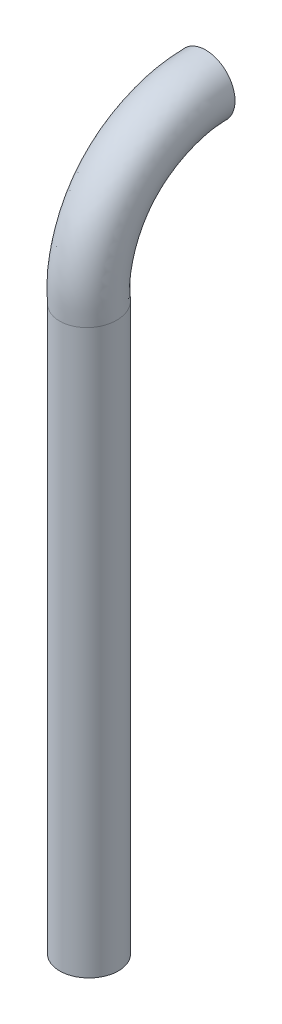
ISO-10303-21;
HEADER;
FILE_DESCRIPTION(('STEP AP214'),'2;1');
FILE_NAME('part.step','',(''),(''),'','','');
FILE_SCHEMA(('AUTOMOTIVE_DESIGN { 1 0 10303 214 1 1 1 1 }'));
ENDSEC;
DATA;
#1=APPLICATION_CONTEXT('core data for automotive mechanical design processes');
#2=APPLICATION_PROTOCOL_DEFINITION('international standard','automotive_design',2000,#1);
#3=PRODUCT_CONTEXT('',#1,'mechanical');
#4=PRODUCT('Part','Part','',(#3));
#5=PRODUCT_RELATED_PRODUCT_CATEGORY('part','',(#4));
#6=PRODUCT_DEFINITION_FORMATION('','',#4);
#7=PRODUCT_DEFINITION_CONTEXT('part definition',#1,'design');
#8=PRODUCT_DEFINITION('design','',#6,#7);
#9=PRODUCT_DEFINITION_SHAPE('','',#8);
#10=(LENGTH_UNIT() NAMED_UNIT(*) SI_UNIT(.MILLI.,.METRE.));
#11=(NAMED_UNIT(*) PLANE_ANGLE_UNIT() SI_UNIT($,.RADIAN.));
#12=(NAMED_UNIT(*) SI_UNIT($,.STERADIAN.) SOLID_ANGLE_UNIT());
#13=UNCERTAINTY_MEASURE_WITH_UNIT(LENGTH_MEASURE(1.E-05),#10,'distance_accuracy_value','');
#14=(GEOMETRIC_REPRESENTATION_CONTEXT(3) GLOBAL_UNCERTAINTY_ASSIGNED_CONTEXT((#13)) GLOBAL_UNIT_ASSIGNED_CONTEXT((#10,
#11,#12)) REPRESENTATION_CONTEXT('',''));
#15=CARTESIAN_POINT('',(0.,0.,0.));
#16=DIRECTION('',(0.,0.,1.));
#17=DIRECTION('',(1.,0.,0.));
#18=AXIS2_PLACEMENT_3D('',#15,#16,#17);
#19=CARTESIAN_POINT('',(0.500000000000001,12.,0.));
#20=CARTESIAN_POINT('',(0.500000000000001,11.9930657780444,0.116001043276116));
#21=CARTESIAN_POINT('',(0.500000000000001,11.9787542517183,0.355415356132909));
#22=CARTESIAN_POINT('',(0.500000000000001,11.8732889805314,0.710322294278507));
#23=CARTESIAN_POINT('',(0.500000000000001,11.7070321349135,1.05626849236097));
#24=CARTESIAN_POINT('',(0.500000000000001,11.4720913130819,1.37348710465269));
#25=CARTESIAN_POINT('',(0.500000000000001,11.1748759191565,1.63424427024337));
#26=CARTESIAN_POINT('',(0.500000000000001,10.8349846393884,1.82471981164898));
#27=CARTESIAN_POINT('',(0.500000000000001,10.4783081979391,1.94515211226652));
#28=CARTESIAN_POINT('',(0.500000000000001,10.1203360573505,2.00641317133854));
#29=CARTESIAN_POINT('',(0.500000000000001,9.88539442122458,1.99327449950961));
#30=CARTESIAN_POINT('',(0.500000000000001,9.77151871013415,1.98690621323232));
#31=CARTESIAN_POINT('',(0.500000000000001,13.,0.));
#32=CARTESIAN_POINT('',(0.500000000000001,12.9891316338656,0.180227196182847));
#33=CARTESIAN_POINT('',(0.500000000000001,12.9667004355208,0.55219773294359));
#34=CARTESIAN_POINT('',(0.500000000000001,12.8116512221261,1.06789627259224));
#35=CARTESIAN_POINT('',(0.500000000000001,12.5687138056712,1.57523482449269));
#36=CARTESIAN_POINT('',(0.500000000000001,12.2171018532432,2.05199658085992));
#37=CARTESIAN_POINT('',(0.500000000000001,11.7526071013549,2.4599571736331));
#38=CARTESIAN_POINT('',(0.500000000000001,11.2417162354822,2.74364311505457));
#39=CARTESIAN_POINT('',(0.500000000000001,10.7249424302498,2.92014520630552));
#40=CARTESIAN_POINT('',(0.500000000000001,10.1832293149059,3.00852030836141));
#41=CARTESIAN_POINT('',(0.500000000000001,9.86732765540138,2.99396240029424));
#42=CARTESIAN_POINT('',(0.500000000000001,9.71421079325677,2.98690621323232));
#43=CARTESIAN_POINT('',(-0.500000000000001,13.,0.));
#44=CARTESIAN_POINT('',(-0.500000000000001,12.9891316338656,0.180227196182847));
#45=CARTESIAN_POINT('',(-0.500000000000001,12.9667004355208,0.55219773294359));
#46=CARTESIAN_POINT('',(-0.500000000000001,12.8116512221261,1.06789627259224));
#47=CARTESIAN_POINT('',(-0.500000000000001,12.5687138056712,1.57523482449269));
#48=CARTESIAN_POINT('',(-0.500000000000001,12.2171018532432,2.05199658085992));
#49=CARTESIAN_POINT('',(-0.500000000000001,11.7526071013549,2.4599571736331));
#50=CARTESIAN_POINT('',(-0.500000000000001,11.2417162354822,2.74364311505457));
#51=CARTESIAN_POINT('',(-0.500000000000001,10.7249424302498,2.92014520630552));
#52=CARTESIAN_POINT('',(-0.500000000000001,10.1832293149059,3.00852030836141));
#53=CARTESIAN_POINT('',(-0.500000000000001,9.86732765540138,2.99396240029424));
#54=CARTESIAN_POINT('',(-0.500000000000001,9.71421079325677,2.98690621323232));
#55=CARTESIAN_POINT('',(-0.500000000000001,12.,0.));
#56=CARTESIAN_POINT('',(-0.500000000000001,11.9930657780444,0.116001043276116));
#57=CARTESIAN_POINT('',(-0.500000000000001,11.9787542517183,0.355415356132909));
#58=CARTESIAN_POINT('',(-0.500000000000001,11.8732889805314,0.710322294278507));
#59=CARTESIAN_POINT('',(-0.500000000000001,11.7070321349135,1.05626849236097));
#60=CARTESIAN_POINT('',(-0.500000000000001,11.4720913130819,1.37348710465269));
#61=CARTESIAN_POINT('',(-0.500000000000001,11.1748759191565,1.63424427024337));
#62=CARTESIAN_POINT('',(-0.500000000000001,10.8349846393884,1.82471981164898));
#63=CARTESIAN_POINT('',(-0.500000000000001,10.4783081979391,1.94515211226652));
#64=CARTESIAN_POINT('',(-0.500000000000001,10.1203360573505,2.00641317133854));
#65=CARTESIAN_POINT('',(-0.500000000000001,9.88539442122458,1.99327449950961));
#66=CARTESIAN_POINT('',(-0.500000000000001,9.77151871013415,1.98690621323232));
#67=CARTESIAN_POINT('',(-0.500000000000001,11.,0.));
#68=CARTESIAN_POINT('',(-0.500000000000001,10.9969999222232,0.051774890369384));
#69=CARTESIAN_POINT('',(-0.500000000000001,10.9908080679159,0.158632979322228));
#70=CARTESIAN_POINT('',(-0.500000000000001,10.9349267389366,0.352748315964771));
#71=CARTESIAN_POINT('',(-0.500000000000001,10.8453504641559,0.537302160229255));
#72=CARTESIAN_POINT('',(-0.500000000000001,10.7270807729206,0.694977628445463));
#73=CARTESIAN_POINT('',(-0.500000000000001,10.5971447369581,0.808531366853651));
#74=CARTESIAN_POINT('',(-0.500000000000001,10.4282530432947,0.905796508243399));
#75=CARTESIAN_POINT('',(-0.500000000000001,10.2316739656283,0.970159018227536));
#76=CARTESIAN_POINT('',(-0.500000000000001,10.0574427997951,1.00430603431567));
#77=CARTESIAN_POINT('',(-0.500000000000001,9.90346118704778,0.992586598724968));
#78=CARTESIAN_POINT('',(-0.500000000000001,9.82882662701154,0.986906213232319));
#79=CARTESIAN_POINT('',(0.500000000000001,11.,0.));
#80=CARTESIAN_POINT('',(0.500000000000001,10.9969999222232,0.051774890369384));
#81=CARTESIAN_POINT('',(0.500000000000001,10.9908080679159,0.158632979322228));
#82=CARTESIAN_POINT('',(0.500000000000001,10.9349267389366,0.352748315964771));
#83=CARTESIAN_POINT('',(0.500000000000001,10.8453504641559,0.537302160229255));
#84=CARTESIAN_POINT('',(0.500000000000001,10.7270807729206,0.694977628445463));
#85=CARTESIAN_POINT('',(0.500000000000001,10.5971447369581,0.808531366853651));
#86=CARTESIAN_POINT('',(0.500000000000001,10.4282530432947,0.905796508243399));
#87=CARTESIAN_POINT('',(0.500000000000001,10.2316739656283,0.970159018227536));
#88=CARTESIAN_POINT('',(0.500000000000001,10.0574427997951,1.00430603431567));
#89=CARTESIAN_POINT('',(0.500000000000001,9.90346118704778,0.992586598724968));
#90=CARTESIAN_POINT('',(0.500000000000001,9.82882662701154,0.986906213232319));
#91=CARTESIAN_POINT('',(0.500000000000001,12.,0.));
#92=CARTESIAN_POINT('',(0.500000000000001,11.9930657780444,0.116001043276116));
#93=CARTESIAN_POINT('',(0.500000000000001,11.9787542517183,0.355415356132909));
#94=CARTESIAN_POINT('',(0.500000000000001,11.8732889805314,0.710322294278507));
#95=CARTESIAN_POINT('',(0.500000000000001,11.7070321349135,1.05626849236097));
#96=CARTESIAN_POINT('',(0.500000000000001,11.4720913130819,1.37348710465269));
#97=CARTESIAN_POINT('',(0.500000000000001,11.1748759191565,1.63424427024337));
#98=CARTESIAN_POINT('',(0.500000000000001,10.8349846393884,1.82471981164898));
#99=CARTESIAN_POINT('',(0.500000000000001,10.4783081979391,1.94515211226652));
#100=CARTESIAN_POINT('',(0.500000000000001,10.1203360573505,2.00641317133854));
#101=CARTESIAN_POINT('',(0.500000000000001,9.88539442122458,1.99327449950961));
#102=CARTESIAN_POINT('',(0.500000000000001,9.77151871013415,1.98690621323232));
#103=(BOUNDED_SURFACE() B_SPLINE_SURFACE(3,3,((#19,#20,#21,#22,#23,#24,#25,#26,#27,#28,#29,#30),
(#31,#32,#33,#34,#35,#36,#37,#38,#39,#40,#41,#42),(#43,#44,#45,#46,#47,#48,#49,#50,#51,#52,#53,
#54),(#55,#56,#57,#58,#59,#60,#61,#62,#63,#64,#65,#66),(#67,#68,#69,#70,#71,#72,#73,#74,#75,#76,
#77,#78),(#79,#80,#81,#82,#83,#84,#85,#86,#87,#88,#89,#90),(#91,#92,#93,#94,#95,#96,#97,#98,#99,
#100,#101,#102)),.UNSPECIFIED.,.T.,.F.,.F.) B_SPLINE_SURFACE_WITH_KNOTS((4,3,4),(4,1,1,1,1,1,1,
1,1,4),(0.,0.5,1.),(0.,0.103484834511285,0.213582135521359,0.327929790440309,0.444900910622342,
0.563498430107345,0.678249695913363,0.790419034476106,0.898416551984604,1.),
.UNSPECIFIED.) GEOMETRIC_REPRESENTATION_ITEM() RATIONAL_B_SPLINE_SURFACE(((1.,1.,1.,1.,1.,1.,1.,
1.,1.,1.,1.,1.),(0.333333333333333,0.333333333333333,0.333333333333333,0.333333333333333,
0.333333333333333,0.333333333333334,0.333333333333333,0.333333333333333,0.333333333333333,
0.333333333333333,0.333333333333333,0.333333333333333),(0.333333333333333,0.333333333333333,
0.333333333333333,0.333333333333333,0.333333333333333,0.333333333333334,0.333333333333333,
0.333333333333333,0.333333333333333,0.333333333333333,0.333333333333333,0.333333333333333),(1.,
1.,1.,1.,1.,1.,1.,1.,1.,1.,1.,1.),(0.333333333333333,0.333333333333333,0.333333333333333,
0.333333333333333,0.333333333333333,0.333333333333334,0.333333333333333,0.333333333333333,
0.333333333333333,0.333333333333333,0.333333333333333,0.333333333333333),(0.333333333333333,
0.333333333333333,0.333333333333333,0.333333333333333,0.333333333333333,0.333333333333334,
0.333333333333333,0.333333333333333,0.333333333333333,0.333333333333333,0.333333333333333,
0.333333333333333),(1.,1.,1.,1.,1.,1.,1.,1.,1.,1.,1.,1.))) REPRESENTATION_ITEM('') SURFACE());
#104=CARTESIAN_POINT('',(0.,12.,0.));
#105=DIRECTION('',(0.,0.,1.));
#106=DIRECTION('',(1.,0.,0.));
#107=AXIS2_PLACEMENT_3D('',#104,#105,#106);
#108=CIRCLE('',#107,0.500000000000001);
#109=CARTESIAN_POINT('',(0.500000000000001,12.,0.));
#110=VERTEX_POINT('',#109);
#111=EDGE_CURVE('E11',#110,#110,#108,.T.);
#112=CARTESIAN_POINT('',(0.500000000000001,9.77151871013415,1.98690621323232));
#113=CARTESIAN_POINT('',(0.500000000000001,9.82882662701154,0.986906213232319));
#114=CARTESIAN_POINT('',(-0.500000000000001,9.82882662701154,0.986906213232319));
#115=CARTESIAN_POINT('',(-0.500000000000001,9.77151871013415,1.98690621323232));
#116=CARTESIAN_POINT('',(-0.500000000000001,9.71421079325677,2.98690621323232));
#117=CARTESIAN_POINT('',(0.500000000000001,9.71421079325677,2.98690621323232));
#118=CARTESIAN_POINT('',(0.500000000000001,9.77151871013415,1.98690621323232));
#119=(BOUNDED_CURVE() B_SPLINE_CURVE(3,(#112,#113,#114,#115,#116,#117,#118),.UNSPECIFIED.,.T.,
.F.) B_SPLINE_CURVE_WITH_KNOTS((4,3,4),(0.,0.5,1.),
.UNSPECIFIED.) CURVE() GEOMETRIC_REPRESENTATION_ITEM() RATIONAL_B_SPLINE_CURVE((1.,
0.333333333333333,0.333333333333333,1.,0.333333333333333,0.333333333333333,1.)) REPRESENTATION_ITEM(''));
#120=CARTESIAN_POINT('',(0.500000000000001,9.77151871013415,1.98690621323232));
#121=VERTEX_POINT('',#120);
#122=EDGE_CURVE('E50',#121,#121,#119,.T.);
#123=ORIENTED_EDGE('',*,*,#111,.T.);
#124=EDGE_LOOP('',(#123));
#125=FACE_BOUND('',#124,.T.);
#126=ORIENTED_EDGE('',*,*,#122,.T.);
#127=EDGE_LOOP('',(#126));
#128=FACE_BOUND('',#127,.T.);
#129=ADVANCED_FACE('F38',(#125,#128),#103,.T.);
#130=CARTESIAN_POINT('',(0.,12.,0.));
#131=DIRECTION('',(0.,0.,1.));
#132=DIRECTION('',(1.,0.,0.));
#133=AXIS2_PLACEMENT_3D('',#130,#131,#132);
#134=PLANE('',#133);
#135=ORIENTED_EDGE('',*,*,#111,.F.);
#136=EDGE_LOOP('',(#135));
#137=FACE_BOUND('',#136,.T.);
#138=ADVANCED_FACE('F71',(#137),#134,.F.);
#139=CARTESIAN_POINT('',(-0.500000000000001,0.157255388795142,1.98690621323232));
#140=DIRECTION('',(0.,-1.,0.));
#141=DIRECTION('',(0.,0.,-1.));
#142=AXIS2_PLACEMENT_3D('',#139,#140,#141);
#143=PLANE('',#142);
#144=CARTESIAN_POINT('',(0.,0.157255388795142,1.98690621323232));
#145=DIRECTION('',(0.,-1.,0.));
#146=DIRECTION('',(0.,0.,-1.));
#147=AXIS2_PLACEMENT_3D('',#144,#145,#146);
#148=CIRCLE('',#147,0.500000000000001);
#149=CARTESIAN_POINT('',(0.,0.157255388795142,1.48690621323232));
#150=VERTEX_POINT('',#149);
#151=EDGE_CURVE('E46',#150,#150,#148,.T.);
#152=ORIENTED_EDGE('',*,*,#151,.T.);
#153=EDGE_LOOP('',(#152));
#154=FACE_BOUND('',#153,.T.);
#155=ADVANCED_FACE('F66',(#154),#143,.T.);
#156=CARTESIAN_POINT('',(0.500000000000001,9.77151871013415,1.98690621323232));
#157=CARTESIAN_POINT('',(0.500000000000001,0.157255388795142,1.98690621323232));
#158=CARTESIAN_POINT('',(0.500000000000001,9.82882662701154,0.986906213232319));
#159=CARTESIAN_POINT('',(0.500000000000001,0.157255388795142,0.986906213232318));
#160=CARTESIAN_POINT('',(-0.500000000000001,9.82882662701154,0.986906213232319));
#161=CARTESIAN_POINT('',(-0.500000000000001,0.157255388795142,0.986906213232318));
#162=CARTESIAN_POINT('',(-0.500000000000001,9.77151871013415,1.98690621323232));
#163=CARTESIAN_POINT('',(-0.500000000000001,0.157255388795142,1.98690621323232));
#164=CARTESIAN_POINT('',(-0.500000000000001,9.71421079325677,2.98690621323232));
#165=CARTESIAN_POINT('',(-0.500000000000001,0.157255388795142,2.98690621323232));
#166=CARTESIAN_POINT('',(0.500000000000001,9.71421079325677,2.98690621323232));
#167=CARTESIAN_POINT('',(0.500000000000001,0.157255388795142,2.98690621323232));
#168=CARTESIAN_POINT('',(0.500000000000001,9.77151871013415,1.98690621323232));
#169=CARTESIAN_POINT('',(0.500000000000001,0.157255388795142,1.98690621323232));
#170=(BOUNDED_SURFACE() B_SPLINE_SURFACE(3,1,((#156,#157),(#158,#159),(#160,#161),(#162,#163),
(#164,#165),(#166,#167),(#168,#169)),.UNSPECIFIED.,.T.,.F.,.F.) B_SPLINE_SURFACE_WITH_KNOTS((4,
3,4),(2,2),(0.,0.5,1.),(0.,1.),
.UNSPECIFIED.) GEOMETRIC_REPRESENTATION_ITEM() RATIONAL_B_SPLINE_SURFACE(((1.,1.),
(0.333333333333333,0.333333333333333),(0.333333333333333,0.333333333333333),(1.,1.),
(0.333333333333333,0.333333333333333),(0.333333333333333,0.333333333333333),(1.,1.))) REPRESENTATION_ITEM('') SURFACE());
#171=ORIENTED_EDGE('',*,*,#122,.F.);
#172=EDGE_LOOP('',(#171));
#173=FACE_BOUND('',#172,.T.);
#174=ORIENTED_EDGE('',*,*,#151,.F.);
#175=EDGE_LOOP('',(#174));
#176=FACE_BOUND('',#175,.T.);
#177=ADVANCED_FACE('F63',(#173,#176),#170,.F.);
#178=CLOSED_SHELL('',(#129,#138,#155,#177));
#179=MANIFOLD_SOLID_BREP('B2',#178);
#180=ADVANCED_BREP_SHAPE_REPRESENTATION('',(#18,#179),#14);
#181=SHAPE_DEFINITION_REPRESENTATION(#9,#180);
ENDSEC;
END-ISO-10303-21;
